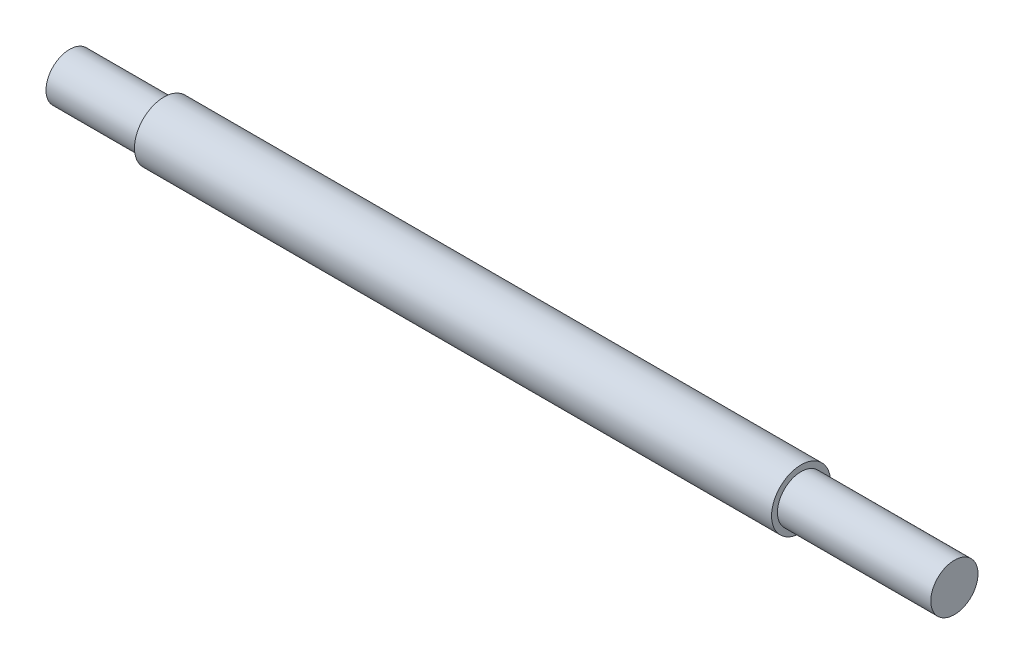
ISO-10303-21;
HEADER;
FILE_DESCRIPTION(('STEP AP214'),'2;1');
FILE_NAME('part.step','',(''),(''),'','','');
FILE_SCHEMA(('AUTOMOTIVE_DESIGN { 1 0 10303 214 1 1 1 1 }'));
ENDSEC;
DATA;
#1=APPLICATION_CONTEXT('core data for automotive mechanical design processes');
#2=APPLICATION_PROTOCOL_DEFINITION('international standard','automotive_design',2000,#1);
#3=PRODUCT_CONTEXT('',#1,'mechanical');
#4=PRODUCT('Part','Part','',(#3));
#5=PRODUCT_RELATED_PRODUCT_CATEGORY('part','',(#4));
#6=PRODUCT_DEFINITION_FORMATION('','',#4);
#7=PRODUCT_DEFINITION_CONTEXT('part definition',#1,'design');
#8=PRODUCT_DEFINITION('design','',#6,#7);
#9=PRODUCT_DEFINITION_SHAPE('','',#8);
#10=(LENGTH_UNIT() NAMED_UNIT(*) SI_UNIT(.MILLI.,.METRE.));
#11=(NAMED_UNIT(*) PLANE_ANGLE_UNIT() SI_UNIT($,.RADIAN.));
#12=(NAMED_UNIT(*) SI_UNIT($,.STERADIAN.) SOLID_ANGLE_UNIT());
#13=UNCERTAINTY_MEASURE_WITH_UNIT(LENGTH_MEASURE(1.E-05),#10,'distance_accuracy_value','');
#14=(GEOMETRIC_REPRESENTATION_CONTEXT(3) GLOBAL_UNCERTAINTY_ASSIGNED_CONTEXT((#13)) GLOBAL_UNIT_ASSIGNED_CONTEXT((#10,
#11,#12)) REPRESENTATION_CONTEXT('',''));
#15=CARTESIAN_POINT('',(0.,0.,0.));
#16=DIRECTION('',(0.,0.,1.));
#17=DIRECTION('',(1.,0.,0.));
#18=AXIS2_PLACEMENT_3D('',#15,#16,#17);
#19=CARTESIAN_POINT('',(35.,0.,0.));
#20=DIRECTION('',(-1.,0.,0.));
#21=DIRECTION('',(0.,0.,1.));
#22=AXIS2_PLACEMENT_3D('',#19,#20,#21);
#23=CYLINDRICAL_SURFACE('',#22,2.5);
#24=CARTESIAN_POINT('',(27.,0.,0.));
#25=DIRECTION('',(1.,0.,0.));
#26=DIRECTION('',(0.,0.,-1.));
#27=AXIS2_PLACEMENT_3D('',#24,#25,#26);
#28=CIRCLE('',#27,2.5);
#29=CARTESIAN_POINT('',(27.,0.,-2.5));
#30=VERTEX_POINT('',#29);
#31=EDGE_CURVE('E10',#30,#30,#28,.T.);
#32=ORIENTED_EDGE('',*,*,#31,.F.);
#33=EDGE_LOOP('',(#32));
#34=FACE_BOUND('',#33,.T.);
#35=CARTESIAN_POINT('',(-27.,0.,0.));
#36=DIRECTION('',(-1.,0.,0.));
#37=DIRECTION('',(0.,0.,1.));
#38=AXIS2_PLACEMENT_3D('',#35,#36,#37);
#39=CIRCLE('',#38,2.5);
#40=CARTESIAN_POINT('',(-27.,0.,2.5));
#41=VERTEX_POINT('',#40);
#42=EDGE_CURVE('E47',#41,#41,#39,.T.);
#43=ORIENTED_EDGE('',*,*,#42,.F.);
#44=EDGE_LOOP('',(#43));
#45=FACE_BOUND('',#44,.T.);
#46=ADVANCED_FACE('F37',(#34,#45),#23,.T.);
#47=CARTESIAN_POINT('',(27.,0.,0.));
#48=DIRECTION('',(1.,0.,0.));
#49=DIRECTION('',(0.,0.,-1.));
#50=AXIS2_PLACEMENT_3D('',#47,#48,#49);
#51=PLANE('',#50);
#52=CARTESIAN_POINT('',(27.,0.,0.));
#53=DIRECTION('',(1.,0.,0.));
#54=DIRECTION('',(0.,0.,-1.));
#55=AXIS2_PLACEMENT_3D('',#52,#53,#54);
#56=CIRCLE('',#55,2.);
#57=CARTESIAN_POINT('',(27.,0.,-2.));
#58=VERTEX_POINT('',#57);
#59=EDGE_CURVE('E43',#58,#58,#56,.T.);
#60=ORIENTED_EDGE('',*,*,#59,.F.);
#61=EDGE_LOOP('',(#60));
#62=FACE_BOUND('',#61,.T.);
#63=ORIENTED_EDGE('',*,*,#31,.T.);
#64=EDGE_LOOP('',(#63));
#65=FACE_BOUND('',#64,.T.);
#66=ADVANCED_FACE('F68',(#62,#65),#51,.T.);
#67=CARTESIAN_POINT('',(27.,0.,0.));
#68=DIRECTION('',(1.,0.,0.));
#69=DIRECTION('',(0.,0.,-1.));
#70=AXIS2_PLACEMENT_3D('',#67,#68,#69);
#71=CYLINDRICAL_SURFACE('',#70,2.);
#72=ORIENTED_EDGE('',*,*,#59,.T.);
#73=EDGE_LOOP('',(#72));
#74=FACE_BOUND('',#73,.T.);
#75=CARTESIAN_POINT('',(40.,0.,0.));
#76=DIRECTION('',(1.,0.,0.));
#77=DIRECTION('',(0.,0.,-1.));
#78=AXIS2_PLACEMENT_3D('',#75,#76,#77);
#79=CIRCLE('',#78,2.);
#80=CARTESIAN_POINT('',(40.,0.,-2.));
#81=VERTEX_POINT('',#80);
#82=EDGE_CURVE('E57',#81,#81,#79,.T.);
#83=ORIENTED_EDGE('',*,*,#82,.F.);
#84=EDGE_LOOP('',(#83));
#85=FACE_BOUND('',#84,.T.);
#86=ADVANCED_FACE('F65',(#74,#85),#71,.T.);
#87=CARTESIAN_POINT('',(-27.,0.,0.));
#88=DIRECTION('',(-1.,0.,0.));
#89=DIRECTION('',(0.,0.,1.));
#90=AXIS2_PLACEMENT_3D('',#87,#88,#89);
#91=PLANE('',#90);
#92=CARTESIAN_POINT('',(-27.,0.,0.));
#93=DIRECTION('',(-1.,0.,0.));
#94=DIRECTION('',(0.,0.,1.));
#95=AXIS2_PLACEMENT_3D('',#92,#93,#94);
#96=CIRCLE('',#95,2.);
#97=CARTESIAN_POINT('',(-27.,0.,2.));
#98=VERTEX_POINT('',#97);
#99=EDGE_CURVE('E51',#98,#98,#96,.T.);
#100=ORIENTED_EDGE('',*,*,#99,.F.);
#101=EDGE_LOOP('',(#100));
#102=FACE_BOUND('',#101,.T.);
#103=ORIENTED_EDGE('',*,*,#42,.T.);
#104=EDGE_LOOP('',(#103));
#105=FACE_BOUND('',#104,.T.);
#106=ADVANCED_FACE('F67',(#102,#105),#91,.T.);
#107=CARTESIAN_POINT('',(-27.,0.,0.));
#108=DIRECTION('',(-1.,0.,0.));
#109=DIRECTION('',(0.,0.,1.));
#110=AXIS2_PLACEMENT_3D('',#107,#108,#109);
#111=CYLINDRICAL_SURFACE('',#110,2.);
#112=ORIENTED_EDGE('',*,*,#99,.T.);
#113=EDGE_LOOP('',(#112));
#114=FACE_BOUND('',#113,.T.);
#115=CARTESIAN_POINT('',(-35.,0.,0.));
#116=DIRECTION('',(-1.,0.,0.));
#117=DIRECTION('',(0.,0.,1.));
#118=AXIS2_PLACEMENT_3D('',#115,#116,#117);
#119=CIRCLE('',#118,2.);
#120=CARTESIAN_POINT('',(-35.,0.,2.));
#121=VERTEX_POINT('',#120);
#122=EDGE_CURVE('E54',#121,#121,#119,.T.);
#123=ORIENTED_EDGE('',*,*,#122,.F.);
#124=EDGE_LOOP('',(#123));
#125=FACE_BOUND('',#124,.T.);
#126=ADVANCED_FACE('F75',(#114,#125),#111,.T.);
#127=CARTESIAN_POINT('',(-35.,0.,0.));
#128=DIRECTION('',(1.,0.,0.));
#129=DIRECTION('',(0.,0.,-1.));
#130=AXIS2_PLACEMENT_3D('',#127,#128,#129);
#131=PLANE('',#130);
#132=ORIENTED_EDGE('',*,*,#122,.T.);
#133=EDGE_LOOP('',(#132));
#134=FACE_BOUND('',#133,.T.);
#135=ADVANCED_FACE('F101',(#134),#131,.F.);
#136=CARTESIAN_POINT('',(40.,0.,0.));
#137=DIRECTION('',(1.,0.,0.));
#138=DIRECTION('',(0.,0.,-1.));
#139=AXIS2_PLACEMENT_3D('',#136,#137,#138);
#140=PLANE('',#139);
#141=ORIENTED_EDGE('',*,*,#82,.T.);
#142=EDGE_LOOP('',(#141));
#143=FACE_BOUND('',#142,.T.);
#144=ADVANCED_FACE('F63',(#143),#140,.T.);
#145=CLOSED_SHELL('',(#46,#66,#86,#106,#126,#135,#144));
#146=MANIFOLD_SOLID_BREP('B2',#145);
#147=ADVANCED_BREP_SHAPE_REPRESENTATION('',(#18,#146),#14);
#148=SHAPE_DEFINITION_REPRESENTATION(#9,#147);
ENDSEC;
END-ISO-10303-21;
